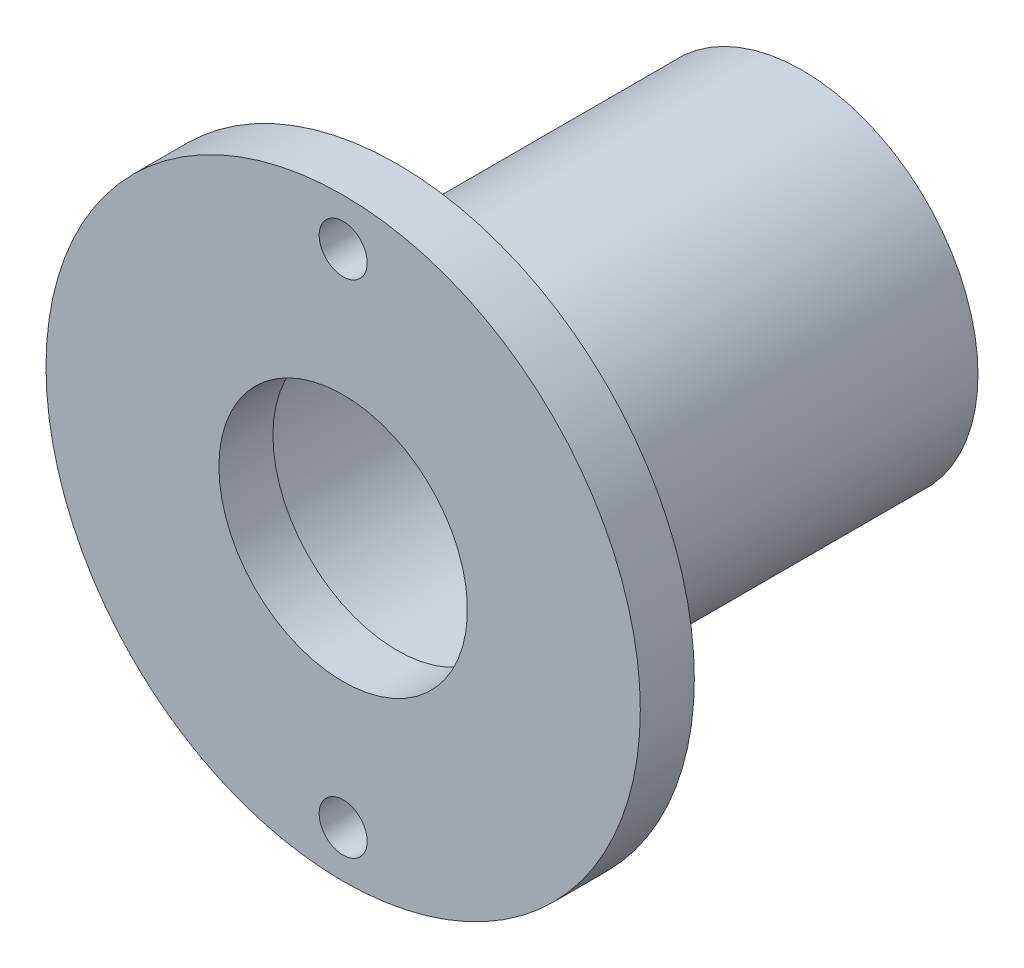
ISO-10303-21;
HEADER;
FILE_DESCRIPTION(('STEP AP214'),'2;1');
FILE_NAME('part.step','',(''),(''),'','','');
FILE_SCHEMA(('AUTOMOTIVE_DESIGN { 1 0 10303 214 1 1 1 1 }'));
ENDSEC;
DATA;
#1=APPLICATION_CONTEXT('core data for automotive mechanical design processes');
#2=APPLICATION_PROTOCOL_DEFINITION('international standard','automotive_design',2000,#1);
#3=PRODUCT_CONTEXT('',#1,'mechanical');
#4=PRODUCT('Part','Part','',(#3));
#5=PRODUCT_RELATED_PRODUCT_CATEGORY('part','',(#4));
#6=PRODUCT_DEFINITION_FORMATION('','',#4);
#7=PRODUCT_DEFINITION_CONTEXT('part definition',#1,'design');
#8=PRODUCT_DEFINITION('design','',#6,#7);
#9=PRODUCT_DEFINITION_SHAPE('','',#8);
#10=(LENGTH_UNIT() NAMED_UNIT(*) SI_UNIT(.MILLI.,.METRE.));
#11=(NAMED_UNIT(*) PLANE_ANGLE_UNIT() SI_UNIT($,.RADIAN.));
#12=(NAMED_UNIT(*) SI_UNIT($,.STERADIAN.) SOLID_ANGLE_UNIT());
#13=UNCERTAINTY_MEASURE_WITH_UNIT(LENGTH_MEASURE(1.E-05),#10,'distance_accuracy_value','');
#14=(GEOMETRIC_REPRESENTATION_CONTEXT(3) GLOBAL_UNCERTAINTY_ASSIGNED_CONTEXT((#13)) GLOBAL_UNIT_ASSIGNED_CONTEXT((#10,
#11,#12)) REPRESENTATION_CONTEXT('',''));
#15=CARTESIAN_POINT('',(0.,0.,0.));
#16=DIRECTION('',(0.,0.,1.));
#17=DIRECTION('',(1.,0.,0.));
#18=AXIS2_PLACEMENT_3D('',#15,#16,#17);
#19=CARTESIAN_POINT('',(0.,0.,0.));
#20=DIRECTION('',(0.,0.,-1.));
#21=DIRECTION('',(-1.,0.,0.));
#22=AXIS2_PLACEMENT_3D('',#19,#20,#21);
#23=CYLINDRICAL_SURFACE('',#22,11.);
#24=CARTESIAN_POINT('',(0.,0.,0.));
#25=DIRECTION('',(0.,0.,-1.));
#26=DIRECTION('',(-1.,0.,0.));
#27=AXIS2_PLACEMENT_3D('',#24,#25,#26);
#28=CIRCLE('',#27,11.);
#29=CARTESIAN_POINT('',(-11.,0.,0.));
#30=VERTEX_POINT('',#29);
#31=EDGE_CURVE('E10',#30,#30,#28,.T.);
#32=ORIENTED_EDGE('',*,*,#31,.T.);
#33=EDGE_LOOP('',(#32));
#34=FACE_BOUND('',#33,.T.);
#35=CARTESIAN_POINT('',(0.,0.,-1.99999999999999));
#36=DIRECTION('',(0.,0.,-1.));
#37=DIRECTION('',(-1.,0.,0.));
#38=AXIS2_PLACEMENT_3D('',#35,#36,#37);
#39=CIRCLE('',#38,11.);
#40=CARTESIAN_POINT('',(-11.,0.,-1.99999999999999));
#41=VERTEX_POINT('',#40);
#42=EDGE_CURVE('E65',#41,#41,#39,.T.);
#43=ORIENTED_EDGE('',*,*,#42,.F.);
#44=EDGE_LOOP('',(#43));
#45=FACE_BOUND('',#44,.T.);
#46=ADVANCED_FACE('F31',(#34,#45),#23,.T.);
#47=CARTESIAN_POINT('',(0.,11.,0.));
#48=DIRECTION('',(0.,0.,1.));
#49=DIRECTION('',(1.,0.,0.));
#50=AXIS2_PLACEMENT_3D('',#47,#48,#49);
#51=PLANE('',#50);
#52=CARTESIAN_POINT('',(0.,9.2718,0.));
#53=DIRECTION('',(0.,0.,1.));
#54=DIRECTION('',(1.,0.,0.));
#55=AXIS2_PLACEMENT_3D('',#52,#53,#54);
#56=CIRCLE('',#55,0.888999999999996);
#57=CARTESIAN_POINT('',(0.889000000000001,9.2718,0.));
#58=VERTEX_POINT('',#57);
#59=EDGE_CURVE('E74',#58,#58,#56,.T.);
#60=ORIENTED_EDGE('',*,*,#59,.F.);
#61=EDGE_LOOP('',(#60));
#62=FACE_BOUND('',#61,.T.);
#63=CARTESIAN_POINT('',(0.,-9.2718,0.));
#64=DIRECTION('',(0.,0.,1.));
#65=DIRECTION('',(1.,0.,0.));
#66=AXIS2_PLACEMENT_3D('',#63,#64,#65);
#67=CIRCLE('',#66,0.888999999999996);
#68=CARTESIAN_POINT('',(0.888999999999995,-9.2718,0.));
#69=VERTEX_POINT('',#68);
#70=EDGE_CURVE('E68',#69,#69,#67,.T.);
#71=ORIENTED_EDGE('',*,*,#70,.F.);
#72=EDGE_LOOP('',(#71));
#73=FACE_BOUND('',#72,.T.);
#74=CARTESIAN_POINT('',(0.,0.,0.));
#75=DIRECTION('',(0.,0.,-1.));
#76=DIRECTION('',(-1.,0.,0.));
#77=AXIS2_PLACEMENT_3D('',#74,#75,#76);
#78=CIRCLE('',#77,4.6);
#79=CARTESIAN_POINT('',(-4.6,0.,0.));
#80=VERTEX_POINT('',#79);
#81=EDGE_CURVE('E37',#80,#80,#78,.T.);
#82=ORIENTED_EDGE('',*,*,#81,.T.);
#83=EDGE_LOOP('',(#82));
#84=FACE_BOUND('',#83,.T.);
#85=ORIENTED_EDGE('',*,*,#31,.F.);
#86=EDGE_LOOP('',(#85));
#87=FACE_BOUND('',#86,.T.);
#88=ADVANCED_FACE('F133',(#62,#73,#84,#87),#51,.T.);
#89=CARTESIAN_POINT('',(0.,0.,0.));
#90=DIRECTION('',(0.,0.,-1.));
#91=DIRECTION('',(-1.,0.,0.));
#92=AXIS2_PLACEMENT_3D('',#89,#90,#91);
#93=CYLINDRICAL_SURFACE('',#92,4.6);
#94=CARTESIAN_POINT('',(0.,0.,-2.));
#95=DIRECTION('',(0.,0.,-1.));
#96=DIRECTION('',(-1.,0.,0.));
#97=AXIS2_PLACEMENT_3D('',#94,#95,#96);
#98=CIRCLE('',#97,4.6);
#99=CARTESIAN_POINT('',(-4.6,0.,-2.));
#100=VERTEX_POINT('',#99);
#101=EDGE_CURVE('E41',#100,#100,#98,.T.);
#102=ORIENTED_EDGE('',*,*,#101,.T.);
#103=EDGE_LOOP('',(#102));
#104=FACE_BOUND('',#103,.T.);
#105=ORIENTED_EDGE('',*,*,#81,.F.);
#106=EDGE_LOOP('',(#105));
#107=FACE_BOUND('',#106,.T.);
#108=ADVANCED_FACE('F127',(#104,#107),#93,.F.);
#109=CARTESIAN_POINT('',(0.,4.6,-2.));
#110=DIRECTION('',(0.,0.,-1.));
#111=DIRECTION('',(-1.,0.,0.));
#112=AXIS2_PLACEMENT_3D('',#109,#110,#111);
#113=PLANE('',#112);
#114=CARTESIAN_POINT('',(0.,0.,-2.));
#115=DIRECTION('',(0.,0.,-1.));
#116=DIRECTION('',(-1.,0.,0.));
#117=AXIS2_PLACEMENT_3D('',#114,#115,#116);
#118=CIRCLE('',#117,5.275);
#119=CARTESIAN_POINT('',(-5.275,0.,-2.));
#120=VERTEX_POINT('',#119);
#121=EDGE_CURVE('E45',#120,#120,#118,.T.);
#122=ORIENTED_EDGE('',*,*,#121,.T.);
#123=EDGE_LOOP('',(#122));
#124=FACE_BOUND('',#123,.T.);
#125=ORIENTED_EDGE('',*,*,#101,.F.);
#126=EDGE_LOOP('',(#125));
#127=FACE_BOUND('',#126,.T.);
#128=ADVANCED_FACE('F121',(#124,#127),#113,.T.);
#129=CARTESIAN_POINT('',(0.,0.,0.));
#130=DIRECTION('',(0.,0.,-1.));
#131=DIRECTION('',(-1.,0.,0.));
#132=AXIS2_PLACEMENT_3D('',#129,#130,#131);
#133=CYLINDRICAL_SURFACE('',#132,5.275);
#134=CARTESIAN_POINT('',(0.,0.,-7.99999999999999));
#135=DIRECTION('',(0.,0.,-1.));
#136=DIRECTION('',(-1.,0.,0.));
#137=AXIS2_PLACEMENT_3D('',#134,#135,#136);
#138=CIRCLE('',#137,5.275);
#139=CARTESIAN_POINT('',(-5.275,0.,-7.99999999999999));
#140=VERTEX_POINT('',#139);
#141=EDGE_CURVE('E50',#140,#140,#138,.T.);
#142=ORIENTED_EDGE('',*,*,#141,.T.);
#143=EDGE_LOOP('',(#142));
#144=FACE_BOUND('',#143,.T.);
#145=ORIENTED_EDGE('',*,*,#121,.F.);
#146=EDGE_LOOP('',(#145));
#147=FACE_BOUND('',#146,.T.);
#148=ADVANCED_FACE('F115',(#144,#147),#133,.F.);
#149=CARTESIAN_POINT('',(0.,5.275,-7.99999999999999));
#150=DIRECTION('',(0.,0.,-1.));
#151=DIRECTION('',(-1.,0.,0.));
#152=AXIS2_PLACEMENT_3D('',#149,#150,#151);
#153=PLANE('',#152);
#154=CARTESIAN_POINT('',(0.,0.,-7.99999999999999));
#155=DIRECTION('',(0.,0.,-1.));
#156=DIRECTION('',(-1.,0.,0.));
#157=AXIS2_PLACEMENT_3D('',#154,#155,#156);
#158=CIRCLE('',#157,5.5);
#159=CARTESIAN_POINT('',(-5.5,0.,-7.99999999999999));
#160=VERTEX_POINT('',#159);
#161=EDGE_CURVE('E53',#160,#160,#158,.T.);
#162=ORIENTED_EDGE('',*,*,#161,.T.);
#163=EDGE_LOOP('',(#162));
#164=FACE_BOUND('',#163,.T.);
#165=ORIENTED_EDGE('',*,*,#141,.F.);
#166=EDGE_LOOP('',(#165));
#167=FACE_BOUND('',#166,.T.);
#168=ADVANCED_FACE('F109',(#164,#167),#153,.T.);
#169=CARTESIAN_POINT('',(0.,0.,0.));
#170=DIRECTION('',(0.,0.,-1.));
#171=DIRECTION('',(-1.,0.,0.));
#172=AXIS2_PLACEMENT_3D('',#169,#170,#171);
#173=CYLINDRICAL_SURFACE('',#172,5.5);
#174=CARTESIAN_POINT('',(0.,0.,-17.));
#175=DIRECTION('',(0.,0.,-1.));
#176=DIRECTION('',(-1.,0.,0.));
#177=AXIS2_PLACEMENT_3D('',#174,#175,#176);
#178=CIRCLE('',#177,5.5);
#179=CARTESIAN_POINT('',(-5.5,0.,-17.));
#180=VERTEX_POINT('',#179);
#181=EDGE_CURVE('E56',#180,#180,#178,.T.);
#182=ORIENTED_EDGE('',*,*,#181,.T.);
#183=EDGE_LOOP('',(#182));
#184=FACE_BOUND('',#183,.T.);
#185=ORIENTED_EDGE('',*,*,#161,.F.);
#186=EDGE_LOOP('',(#185));
#187=FACE_BOUND('',#186,.T.);
#188=ADVANCED_FACE('F103',(#184,#187),#173,.F.);
#189=CARTESIAN_POINT('',(0.,5.5,-17.));
#190=DIRECTION('',(0.,0.,-1.));
#191=DIRECTION('',(-1.,0.,0.));
#192=AXIS2_PLACEMENT_3D('',#189,#190,#191);
#193=PLANE('',#192);
#194=CARTESIAN_POINT('',(0.,0.,-17.));
#195=DIRECTION('',(0.,0.,-1.));
#196=DIRECTION('',(-1.,0.,0.));
#197=AXIS2_PLACEMENT_3D('',#194,#195,#196);
#198=CIRCLE('',#197,6.5);
#199=CARTESIAN_POINT('',(-6.5,0.,-17.));
#200=VERTEX_POINT('',#199);
#201=EDGE_CURVE('E59',#200,#200,#198,.T.);
#202=ORIENTED_EDGE('',*,*,#201,.T.);
#203=EDGE_LOOP('',(#202));
#204=FACE_BOUND('',#203,.T.);
#205=ORIENTED_EDGE('',*,*,#181,.F.);
#206=EDGE_LOOP('',(#205));
#207=FACE_BOUND('',#206,.T.);
#208=ADVANCED_FACE('F97',(#204,#207),#193,.T.);
#209=CARTESIAN_POINT('',(0.,0.,0.));
#210=DIRECTION('',(0.,0.,-1.));
#211=DIRECTION('',(-1.,0.,0.));
#212=AXIS2_PLACEMENT_3D('',#209,#210,#211);
#213=CYLINDRICAL_SURFACE('',#212,6.5);
#214=CARTESIAN_POINT('',(0.,0.,-1.99999999999999));
#215=DIRECTION('',(0.,0.,-1.));
#216=DIRECTION('',(-1.,0.,0.));
#217=AXIS2_PLACEMENT_3D('',#214,#215,#216);
#218=CIRCLE('',#217,6.49999999999999);
#219=CARTESIAN_POINT('',(-6.49999999999999,0.,-1.99999999999999));
#220=VERTEX_POINT('',#219);
#221=EDGE_CURVE('E62',#220,#220,#218,.T.);
#222=ORIENTED_EDGE('',*,*,#221,.T.);
#223=EDGE_LOOP('',(#222));
#224=FACE_BOUND('',#223,.T.);
#225=ORIENTED_EDGE('',*,*,#201,.F.);
#226=EDGE_LOOP('',(#225));
#227=FACE_BOUND('',#226,.T.);
#228=ADVANCED_FACE('F87',(#224,#227),#213,.T.);
#229=CARTESIAN_POINT('',(0.,6.49999999999999,-1.99999999999999));
#230=DIRECTION('',(0.,0.,-1.));
#231=DIRECTION('',(-1.,0.,0.));
#232=AXIS2_PLACEMENT_3D('',#229,#230,#231);
#233=PLANE('',#232);
#234=CARTESIAN_POINT('',(0.,9.2718,-1.99999999999999));
#235=DIRECTION('',(0.,0.,-1.));
#236=DIRECTION('',(-1.,0.,0.));
#237=AXIS2_PLACEMENT_3D('',#234,#235,#236);
#238=CIRCLE('',#237,0.888999999999998);
#239=CARTESIAN_POINT('',(-0.888999999999993,9.2718,-1.99999999999999));
#240=VERTEX_POINT('',#239);
#241=EDGE_CURVE('E77',#240,#240,#238,.T.);
#242=ORIENTED_EDGE('',*,*,#241,.F.);
#243=EDGE_LOOP('',(#242));
#244=FACE_BOUND('',#243,.T.);
#245=CARTESIAN_POINT('',(0.,-9.2718,-1.99999999999999));
#246=DIRECTION('',(0.,0.,-1.));
#247=DIRECTION('',(-1.,0.,0.));
#248=AXIS2_PLACEMENT_3D('',#245,#246,#247);
#249=CIRCLE('',#248,0.888999999999998);
#250=CARTESIAN_POINT('',(-0.888999999999999,-9.2718,-1.99999999999999));
#251=VERTEX_POINT('',#250);
#252=EDGE_CURVE('E71',#251,#251,#249,.T.);
#253=ORIENTED_EDGE('',*,*,#252,.F.);
#254=EDGE_LOOP('',(#253));
#255=FACE_BOUND('',#254,.T.);
#256=ORIENTED_EDGE('',*,*,#42,.T.);
#257=EDGE_LOOP('',(#256));
#258=FACE_BOUND('',#257,.T.);
#259=ORIENTED_EDGE('',*,*,#221,.F.);
#260=EDGE_LOOP('',(#259));
#261=FACE_BOUND('',#260,.T.);
#262=ADVANCED_FACE('F83',(#244,#255,#258,#261),#233,.T.);
#263=CARTESIAN_POINT('',(0.,-9.2718,-1.99999999999999));
#264=DIRECTION('',(0.,0.,-1.));
#265=DIRECTION('',(-1.,0.,0.));
#266=AXIS2_PLACEMENT_3D('',#263,#264,#265);
#267=CYLINDRICAL_SURFACE('',#266,0.888999999999996);
#268=ORIENTED_EDGE('',*,*,#70,.T.);
#269=EDGE_LOOP('',(#268));
#270=FACE_BOUND('',#269,.T.);
#271=ORIENTED_EDGE('',*,*,#252,.T.);
#272=EDGE_LOOP('',(#271));
#273=FACE_BOUND('',#272,.T.);
#274=ADVANCED_FACE('F86',(#270,#273),#267,.F.);
#275=CARTESIAN_POINT('',(0.,9.2718,-1.99999999999999));
#276=DIRECTION('',(0.,0.,-1.));
#277=DIRECTION('',(-1.,0.,0.));
#278=AXIS2_PLACEMENT_3D('',#275,#276,#277);
#279=CYLINDRICAL_SURFACE('',#278,0.888999999999996);
#280=ORIENTED_EDGE('',*,*,#59,.T.);
#281=EDGE_LOOP('',(#280));
#282=FACE_BOUND('',#281,.T.);
#283=ORIENTED_EDGE('',*,*,#241,.T.);
#284=EDGE_LOOP('',(#283));
#285=FACE_BOUND('',#284,.T.);
#286=ADVANCED_FACE('F81',(#282,#285),#279,.F.);
#287=CLOSED_SHELL('',(#46,#88,#108,#128,#148,#168,#188,#208,#228,#262,#274,#286));
#288=MANIFOLD_SOLID_BREP('B2',#287);
#289=ADVANCED_BREP_SHAPE_REPRESENTATION('',(#18,#288),#14);
#290=SHAPE_DEFINITION_REPRESENTATION(#9,#289);
ENDSEC;
END-ISO-10303-21;
